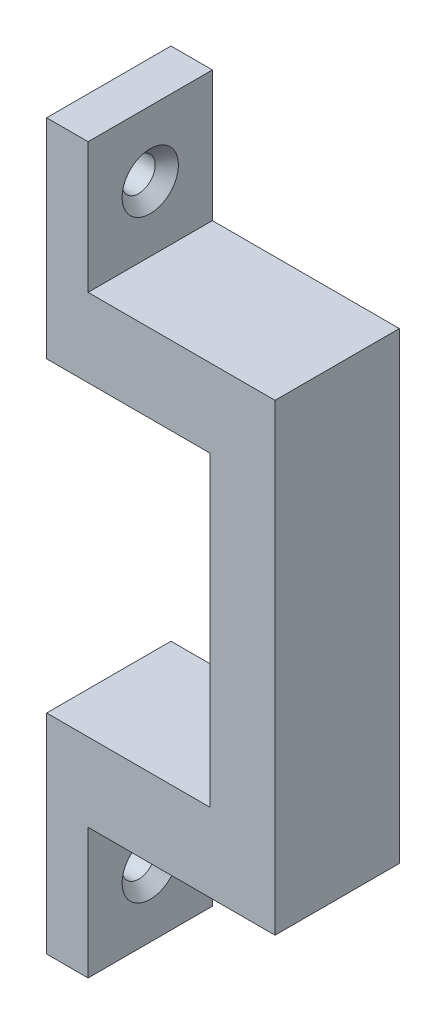
ISO-10303-21;
HEADER;
FILE_DESCRIPTION(('STEP AP214'),'2;1');
FILE_NAME('part.step','',(''),(''),'','','');
FILE_SCHEMA(('AUTOMOTIVE_DESIGN { 1 0 10303 214 1 1 1 1 }'));
ENDSEC;
DATA;
#1=APPLICATION_CONTEXT('core data for automotive mechanical design processes');
#2=APPLICATION_PROTOCOL_DEFINITION('international standard','automotive_design',2000,#1);
#3=PRODUCT_CONTEXT('',#1,'mechanical');
#4=PRODUCT('Part','Part','',(#3));
#5=PRODUCT_RELATED_PRODUCT_CATEGORY('part','',(#4));
#6=PRODUCT_DEFINITION_FORMATION('','',#4);
#7=PRODUCT_DEFINITION_CONTEXT('part definition',#1,'design');
#8=PRODUCT_DEFINITION('design','',#6,#7);
#9=PRODUCT_DEFINITION_SHAPE('','',#8);
#10=(LENGTH_UNIT() NAMED_UNIT(*) SI_UNIT(.MILLI.,.METRE.));
#11=(NAMED_UNIT(*) PLANE_ANGLE_UNIT() SI_UNIT($,.RADIAN.));
#12=(NAMED_UNIT(*) SI_UNIT($,.STERADIAN.) SOLID_ANGLE_UNIT());
#13=UNCERTAINTY_MEASURE_WITH_UNIT(LENGTH_MEASURE(1.E-05),#10,'distance_accuracy_value','');
#14=(GEOMETRIC_REPRESENTATION_CONTEXT(3) GLOBAL_UNCERTAINTY_ASSIGNED_CONTEXT((#13)) GLOBAL_UNIT_ASSIGNED_CONTEXT((#10,
#11,#12)) REPRESENTATION_CONTEXT('',''));
#15=CARTESIAN_POINT('',(0.,0.,0.));
#16=DIRECTION('',(0.,0.,1.));
#17=DIRECTION('',(1.,0.,0.));
#18=AXIS2_PLACEMENT_3D('',#15,#16,#17);
#19=CARTESIAN_POINT('',(-12.5,11.75,9.525));
#20=DIRECTION('',(1.,0.,0.));
#21=DIRECTION('',(0.,1.,0.));
#22=AXIS2_PLACEMENT_3D('',#19,#20,#21);
#23=PLANE('',#22);
#24=CARTESIAN_POINT('',(-12.5,22.75,4.7625));
#25=DIRECTION('',(1.,0.,0.));
#26=DIRECTION('',(0.,0.,-1.));
#27=AXIS2_PLACEMENT_3D('',#24,#25,#26);
#28=CIRCLE('',#27,1.27);
#29=CARTESIAN_POINT('',(-12.5,22.75,3.4925));
#30=VERTEX_POINT('',#29);
#31=EDGE_CURVE('E304',#30,#30,#28,.T.);
#32=ORIENTED_EDGE('',*,*,#31,.T.);
#33=EDGE_LOOP('',(#32));
#34=FACE_BOUND('',#33,.T.);
#35=DIRECTION('',(0.,-1.,0.));
#36=VECTOR('',#35,1.);
#37=CARTESIAN_POINT('',(-12.5,11.75,0.));
#38=LINE('',#37,#36);
#39=CARTESIAN_POINT('',(-12.5,27.75,0.));
#40=VERTEX_POINT('',#39);
#41=CARTESIAN_POINT('',(-12.5,11.75,0.));
#42=VERTEX_POINT('',#41);
#43=EDGE_CURVE('E167',#40,#42,#38,.T.);
#44=ORIENTED_EDGE('',*,*,#43,.T.);
#45=DIRECTION('',(0.,0.,-1.));
#46=VECTOR('',#45,1.);
#47=CARTESIAN_POINT('',(-12.5,11.75,9.525));
#48=LINE('',#47,#46);
#49=CARTESIAN_POINT('',(-12.5,11.75,9.525));
#50=VERTEX_POINT('',#49);
#51=EDGE_CURVE('E11',#50,#42,#48,.T.);
#52=ORIENTED_EDGE('',*,*,#51,.F.);
#53=DIRECTION('',(0.,-1.,0.));
#54=VECTOR('',#53,1.);
#55=CARTESIAN_POINT('',(-12.5,11.75,9.525));
#56=LINE('',#55,#54);
#57=CARTESIAN_POINT('',(-12.5,27.75,9.525));
#58=VERTEX_POINT('',#57);
#59=EDGE_CURVE('E202',#58,#50,#56,.T.);
#60=ORIENTED_EDGE('',*,*,#59,.F.);
#61=DIRECTION('',(0.,0.,-1.));
#62=VECTOR('',#61,1.);
#63=CARTESIAN_POINT('',(-12.5,27.75,9.525));
#64=LINE('',#63,#62);
#65=EDGE_CURVE('E163',#58,#40,#64,.T.);
#66=ORIENTED_EDGE('',*,*,#65,.T.);
#67=EDGE_LOOP('',(#44,#52,#60,#66));
#68=FACE_BOUND('',#67,.T.);
#69=ADVANCED_FACE('F39',(#34,#68),#23,.F.);
#70=CARTESIAN_POINT('',(0.,11.75,9.525));
#71=DIRECTION('',(0.,1.,0.));
#72=DIRECTION('',(-1.,0.,0.));
#73=AXIS2_PLACEMENT_3D('',#70,#71,#72);
#74=PLANE('',#73);
#75=DIRECTION('',(1.,0.,0.));
#76=VECTOR('',#75,1.);
#77=CARTESIAN_POINT('',(0.,11.75,0.));
#78=LINE('',#77,#76);
#79=CARTESIAN_POINT('',(0.,11.75,0.));
#80=VERTEX_POINT('',#79);
#81=EDGE_CURVE('E171',#42,#80,#78,.T.);
#82=ORIENTED_EDGE('',*,*,#81,.T.);
#83=DIRECTION('',(0.,0.,-1.));
#84=VECTOR('',#83,1.);
#85=CARTESIAN_POINT('',(0.,11.75,9.525));
#86=LINE('',#85,#84);
#87=CARTESIAN_POINT('',(0.,11.75,9.525));
#88=VERTEX_POINT('',#87);
#89=EDGE_CURVE('E48',#88,#80,#86,.T.);
#90=ORIENTED_EDGE('',*,*,#89,.F.);
#91=DIRECTION('',(1.,0.,0.));
#92=VECTOR('',#91,1.);
#93=CARTESIAN_POINT('',(0.,11.75,9.525));
#94=LINE('',#93,#92);
#95=EDGE_CURVE('E112',#50,#88,#94,.T.);
#96=ORIENTED_EDGE('',*,*,#95,.F.);
#97=ORIENTED_EDGE('',*,*,#51,.T.);
#98=EDGE_LOOP('',(#82,#90,#96,#97));
#99=FACE_BOUND('',#98,.T.);
#100=ADVANCED_FACE('F297',(#99),#74,.F.);
#101=CARTESIAN_POINT('',(0.,11.75,9.525));
#102=DIRECTION('',(1.,0.,0.));
#103=DIRECTION('',(0.,1.,0.));
#104=AXIS2_PLACEMENT_3D('',#101,#102,#103);
#105=PLANE('',#104);
#106=DIRECTION('',(0.,-1.,0.));
#107=VECTOR('',#106,1.);
#108=CARTESIAN_POINT('',(0.,11.75,0.));
#109=LINE('',#108,#107);
#110=CARTESIAN_POINT('',(0.,-11.75,0.));
#111=VERTEX_POINT('',#110);
#112=EDGE_CURVE('E175',#80,#111,#109,.T.);
#113=ORIENTED_EDGE('',*,*,#112,.T.);
#114=DIRECTION('',(0.,0.,-1.));
#115=VECTOR('',#114,1.);
#116=CARTESIAN_POINT('',(0.,-11.75,9.525));
#117=LINE('',#116,#115);
#118=CARTESIAN_POINT('',(0.,-11.75,9.525));
#119=VERTEX_POINT('',#118);
#120=EDGE_CURVE('E229',#119,#111,#117,.T.);
#121=ORIENTED_EDGE('',*,*,#120,.F.);
#122=DIRECTION('',(0.,-1.,0.));
#123=VECTOR('',#122,1.);
#124=CARTESIAN_POINT('',(0.,11.75,9.525));
#125=LINE('',#124,#123);
#126=EDGE_CURVE('E239',#88,#119,#125,.T.);
#127=ORIENTED_EDGE('',*,*,#126,.F.);
#128=ORIENTED_EDGE('',*,*,#89,.T.);
#129=EDGE_LOOP('',(#113,#121,#127,#128));
#130=FACE_BOUND('',#129,.T.);
#131=ADVANCED_FACE('F237',(#130),#105,.F.);
#132=CARTESIAN_POINT('',(-12.5,-11.75,9.525));
#133=DIRECTION('',(0.,-1.,0.));
#134=DIRECTION('',(0.,0.,-1.));
#135=AXIS2_PLACEMENT_3D('',#132,#133,#134);
#136=PLANE('',#135);
#137=DIRECTION('',(-1.,0.,0.));
#138=VECTOR('',#137,1.);
#139=CARTESIAN_POINT('',(-12.5,-11.75,0.));
#140=LINE('',#139,#138);
#141=CARTESIAN_POINT('',(-12.5,-11.75,0.));
#142=VERTEX_POINT('',#141);
#143=EDGE_CURVE('E178',#111,#142,#140,.T.);
#144=ORIENTED_EDGE('',*,*,#143,.T.);
#145=DIRECTION('',(0.,0.,-1.));
#146=VECTOR('',#145,1.);
#147=CARTESIAN_POINT('',(-12.5,-11.75,9.525));
#148=LINE('',#147,#146);
#149=CARTESIAN_POINT('',(-12.5,-11.75,9.525));
#150=VERTEX_POINT('',#149);
#151=EDGE_CURVE('E225',#150,#142,#148,.T.);
#152=ORIENTED_EDGE('',*,*,#151,.F.);
#153=DIRECTION('',(-1.,0.,0.));
#154=VECTOR('',#153,1.);
#155=CARTESIAN_POINT('',(-12.5,-11.75,9.525));
#156=LINE('',#155,#154);
#157=EDGE_CURVE('E258',#119,#150,#156,.T.);
#158=ORIENTED_EDGE('',*,*,#157,.F.);
#159=ORIENTED_EDGE('',*,*,#120,.T.);
#160=EDGE_LOOP('',(#144,#152,#158,#159));
#161=FACE_BOUND('',#160,.T.);
#162=ADVANCED_FACE('F248',(#161),#136,.F.);
#163=CARTESIAN_POINT('',(-12.5,-27.75,9.525));
#164=DIRECTION('',(1.,0.,0.));
#165=DIRECTION('',(0.,0.,-1.));
#166=AXIS2_PLACEMENT_3D('',#163,#164,#165);
#167=PLANE('',#166);
#168=CARTESIAN_POINT('',(-12.5,-22.75,4.7625));
#169=DIRECTION('',(1.,0.,0.));
#170=DIRECTION('',(0.,0.,-1.));
#171=AXIS2_PLACEMENT_3D('',#168,#169,#170);
#172=CIRCLE('',#171,1.27);
#173=CARTESIAN_POINT('',(-12.5,-22.75,3.4925));
#174=VERTEX_POINT('',#173);
#175=EDGE_CURVE('E323',#174,#174,#172,.T.);
#176=ORIENTED_EDGE('',*,*,#175,.T.);
#177=EDGE_LOOP('',(#176));
#178=FACE_BOUND('',#177,.T.);
#179=DIRECTION('',(0.,-1.,0.));
#180=VECTOR('',#179,1.);
#181=CARTESIAN_POINT('',(-12.5,-27.75,0.));
#182=LINE('',#181,#180);
#183=CARTESIAN_POINT('',(-12.5,-27.75,0.));
#184=VERTEX_POINT('',#183);
#185=EDGE_CURVE('E181',#142,#184,#182,.T.);
#186=ORIENTED_EDGE('',*,*,#185,.T.);
#187=DIRECTION('',(0.,0.,-1.));
#188=VECTOR('',#187,1.);
#189=CARTESIAN_POINT('',(-12.5,-27.75,9.525));
#190=LINE('',#189,#188);
#191=CARTESIAN_POINT('',(-12.5,-27.75,9.525));
#192=VERTEX_POINT('',#191);
#193=EDGE_CURVE('E221',#192,#184,#190,.T.);
#194=ORIENTED_EDGE('',*,*,#193,.F.);
#195=DIRECTION('',(0.,-1.,0.));
#196=VECTOR('',#195,1.);
#197=CARTESIAN_POINT('',(-12.5,-27.75,9.525));
#198=LINE('',#197,#196);
#199=EDGE_CURVE('E254',#150,#192,#198,.T.);
#200=ORIENTED_EDGE('',*,*,#199,.F.);
#201=ORIENTED_EDGE('',*,*,#151,.T.);
#202=EDGE_LOOP('',(#186,#194,#200,#201));
#203=FACE_BOUND('',#202,.T.);
#204=ADVANCED_FACE('F252',(#178,#203),#167,.F.);
#205=CARTESIAN_POINT('',(-9.32499999999999,-27.75,9.525));
#206=DIRECTION('',(0.,1.,0.));
#207=DIRECTION('',(0.,0.,1.));
#208=AXIS2_PLACEMENT_3D('',#205,#206,#207);
#209=PLANE('',#208);
#210=DIRECTION('',(1.,0.,0.));
#211=VECTOR('',#210,1.);
#212=CARTESIAN_POINT('',(-9.32499999999999,-27.75,0.));
#213=LINE('',#212,#211);
#214=CARTESIAN_POINT('',(-9.32499999999999,-27.75,0.));
#215=VERTEX_POINT('',#214);
#216=EDGE_CURVE('E184',#184,#215,#213,.T.);
#217=ORIENTED_EDGE('',*,*,#216,.T.);
#218=DIRECTION('',(0.,0.,-1.));
#219=VECTOR('',#218,1.);
#220=CARTESIAN_POINT('',(-9.32499999999999,-27.75,9.525));
#221=LINE('',#220,#219);
#222=CARTESIAN_POINT('',(-9.32499999999999,-27.75,9.525));
#223=VERTEX_POINT('',#222);
#224=EDGE_CURVE('E217',#223,#215,#221,.T.);
#225=ORIENTED_EDGE('',*,*,#224,.F.);
#226=DIRECTION('',(1.,0.,0.));
#227=VECTOR('',#226,1.);
#228=CARTESIAN_POINT('',(-9.32499999999999,-27.75,9.525));
#229=LINE('',#228,#227);
#230=EDGE_CURVE('E257',#192,#223,#229,.T.);
#231=ORIENTED_EDGE('',*,*,#230,.F.);
#232=ORIENTED_EDGE('',*,*,#193,.T.);
#233=EDGE_LOOP('',(#217,#225,#231,#232));
#234=FACE_BOUND('',#233,.T.);
#235=ADVANCED_FACE('F471',(#234),#209,.F.);
#236=CARTESIAN_POINT('',(-9.325,-17.75,9.525));
#237=DIRECTION('',(-1.,0.,0.));
#238=DIRECTION('',(0.,-1.,0.));
#239=AXIS2_PLACEMENT_3D('',#236,#237,#238);
#240=PLANE('',#239);
#241=CARTESIAN_POINT('',(-9.325,-22.75,4.7625));
#242=DIRECTION('',(1.,0.,0.));
#243=DIRECTION('',(0.,0.,-1.));
#244=AXIS2_PLACEMENT_3D('',#241,#242,#243);
#245=CIRCLE('',#244,2.159);
#246=CARTESIAN_POINT('',(-9.325,-22.75,2.6035));
#247=VERTEX_POINT('',#246);
#248=EDGE_CURVE('E307',#247,#247,#245,.T.);
#249=ORIENTED_EDGE('',*,*,#248,.F.);
#250=EDGE_LOOP('',(#249));
#251=FACE_BOUND('',#250,.T.);
#252=DIRECTION('',(0.,1.,0.));
#253=VECTOR('',#252,1.);
#254=CARTESIAN_POINT('',(-9.325,-17.75,0.));
#255=LINE('',#254,#253);
#256=CARTESIAN_POINT('',(-9.325,-17.75,0.));
#257=VERTEX_POINT('',#256);
#258=EDGE_CURVE('E187',#215,#257,#255,.T.);
#259=ORIENTED_EDGE('',*,*,#258,.T.);
#260=DIRECTION('',(0.,0.,-1.));
#261=VECTOR('',#260,1.);
#262=CARTESIAN_POINT('',(-9.325,-17.75,9.525));
#263=LINE('',#262,#261);
#264=CARTESIAN_POINT('',(-9.325,-17.75,9.525));
#265=VERTEX_POINT('',#264);
#266=EDGE_CURVE('E213',#265,#257,#263,.T.);
#267=ORIENTED_EDGE('',*,*,#266,.F.);
#268=DIRECTION('',(0.,1.,0.));
#269=VECTOR('',#268,1.);
#270=CARTESIAN_POINT('',(-9.325,-17.75,9.525));
#271=LINE('',#270,#269);
#272=EDGE_CURVE('E262',#223,#265,#271,.T.);
#273=ORIENTED_EDGE('',*,*,#272,.F.);
#274=ORIENTED_EDGE('',*,*,#224,.T.);
#275=EDGE_LOOP('',(#259,#267,#273,#274));
#276=FACE_BOUND('',#275,.T.);
#277=ADVANCED_FACE('F464',(#251,#276),#240,.F.);
#278=CARTESIAN_POINT('',(5.,-17.75,9.525));
#279=DIRECTION('',(0.,1.,0.));
#280=DIRECTION('',(0.,0.,1.));
#281=AXIS2_PLACEMENT_3D('',#278,#279,#280);
#282=PLANE('',#281);
#283=DIRECTION('',(1.,0.,0.));
#284=VECTOR('',#283,1.);
#285=CARTESIAN_POINT('',(5.,-17.75,0.));
#286=LINE('',#285,#284);
#287=CARTESIAN_POINT('',(5.,-17.75,0.));
#288=VERTEX_POINT('',#287);
#289=EDGE_CURVE('E190',#257,#288,#286,.T.);
#290=ORIENTED_EDGE('',*,*,#289,.T.);
#291=DIRECTION('',(0.,0.,-1.));
#292=VECTOR('',#291,1.);
#293=CARTESIAN_POINT('',(5.,-17.75,9.525));
#294=LINE('',#293,#292);
#295=CARTESIAN_POINT('',(5.,-17.75,9.525));
#296=VERTEX_POINT('',#295);
#297=EDGE_CURVE('E209',#296,#288,#294,.T.);
#298=ORIENTED_EDGE('',*,*,#297,.F.);
#299=DIRECTION('',(1.,0.,0.));
#300=VECTOR('',#299,1.);
#301=CARTESIAN_POINT('',(5.,-17.75,9.525));
#302=LINE('',#301,#300);
#303=EDGE_CURVE('E269',#265,#296,#302,.T.);
#304=ORIENTED_EDGE('',*,*,#303,.F.);
#305=ORIENTED_EDGE('',*,*,#266,.T.);
#306=EDGE_LOOP('',(#290,#298,#304,#305));
#307=FACE_BOUND('',#306,.T.);
#308=ADVANCED_FACE('F277',(#307),#282,.F.);
#309=CARTESIAN_POINT('',(5.,17.75,9.525));
#310=DIRECTION('',(-1.,0.,0.));
#311=DIRECTION('',(0.,0.,1.));
#312=AXIS2_PLACEMENT_3D('',#309,#310,#311);
#313=PLANE('',#312);
#314=DIRECTION('',(0.,1.,0.));
#315=VECTOR('',#314,1.);
#316=CARTESIAN_POINT('',(5.,17.75,0.));
#317=LINE('',#316,#315);
#318=CARTESIAN_POINT('',(5.,17.75,0.));
#319=VERTEX_POINT('',#318);
#320=EDGE_CURVE('E193',#288,#319,#317,.T.);
#321=ORIENTED_EDGE('',*,*,#320,.T.);
#322=DIRECTION('',(0.,0.,-1.));
#323=VECTOR('',#322,1.);
#324=CARTESIAN_POINT('',(5.,17.75,9.525));
#325=LINE('',#324,#323);
#326=CARTESIAN_POINT('',(5.,17.75,9.525));
#327=VERTEX_POINT('',#326);
#328=EDGE_CURVE('E156',#327,#319,#325,.T.);
#329=ORIENTED_EDGE('',*,*,#328,.F.);
#330=DIRECTION('',(0.,1.,0.));
#331=VECTOR('',#330,1.);
#332=CARTESIAN_POINT('',(5.,17.75,9.525));
#333=LINE('',#332,#331);
#334=EDGE_CURVE('E145',#296,#327,#333,.T.);
#335=ORIENTED_EDGE('',*,*,#334,.F.);
#336=ORIENTED_EDGE('',*,*,#297,.T.);
#337=EDGE_LOOP('',(#321,#329,#335,#336));
#338=FACE_BOUND('',#337,.T.);
#339=ADVANCED_FACE('F281',(#338),#313,.F.);
#340=CARTESIAN_POINT('',(-9.325,17.75,9.525));
#341=DIRECTION('',(0.,-1.,0.));
#342=DIRECTION('',(0.,0.,-1.));
#343=AXIS2_PLACEMENT_3D('',#340,#341,#342);
#344=PLANE('',#343);
#345=DIRECTION('',(-1.,0.,0.));
#346=VECTOR('',#345,1.);
#347=CARTESIAN_POINT('',(-9.325,17.75,0.));
#348=LINE('',#347,#346);
#349=CARTESIAN_POINT('',(-9.325,17.75,0.));
#350=VERTEX_POINT('',#349);
#351=EDGE_CURVE('E154',#319,#350,#348,.T.);
#352=ORIENTED_EDGE('',*,*,#351,.T.);
#353=DIRECTION('',(0.,0.,-1.));
#354=VECTOR('',#353,1.);
#355=CARTESIAN_POINT('',(-9.325,17.75,9.525));
#356=LINE('',#355,#354);
#357=CARTESIAN_POINT('',(-9.325,17.75,9.525));
#358=VERTEX_POINT('',#357);
#359=EDGE_CURVE('E151',#358,#350,#356,.T.);
#360=ORIENTED_EDGE('',*,*,#359,.F.);
#361=DIRECTION('',(-1.,0.,0.));
#362=VECTOR('',#361,1.);
#363=CARTESIAN_POINT('',(-9.325,17.75,9.525));
#364=LINE('',#363,#362);
#365=EDGE_CURVE('E139',#327,#358,#364,.T.);
#366=ORIENTED_EDGE('',*,*,#365,.F.);
#367=ORIENTED_EDGE('',*,*,#328,.T.);
#368=EDGE_LOOP('',(#352,#360,#366,#367));
#369=FACE_BOUND('',#368,.T.);
#370=ADVANCED_FACE('F152',(#369),#344,.F.);
#371=CARTESIAN_POINT('',(-9.32499999999999,27.75,9.525));
#372=DIRECTION('',(-1.,0.,0.));
#373=DIRECTION('',(0.,-1.,0.));
#374=AXIS2_PLACEMENT_3D('',#371,#372,#373);
#375=PLANE('',#374);
#376=CARTESIAN_POINT('',(-9.325,22.75,4.7625));
#377=DIRECTION('',(1.,0.,0.));
#378=DIRECTION('',(0.,0.,-1.));
#379=AXIS2_PLACEMENT_3D('',#376,#377,#378);
#380=CIRCLE('',#379,2.159);
#381=CARTESIAN_POINT('',(-9.325,22.75,2.6035));
#382=VERTEX_POINT('',#381);
#383=EDGE_CURVE('E316',#382,#382,#380,.T.);
#384=ORIENTED_EDGE('',*,*,#383,.F.);
#385=EDGE_LOOP('',(#384));
#386=FACE_BOUND('',#385,.T.);
#387=DIRECTION('',(0.,1.,0.));
#388=VECTOR('',#387,1.);
#389=CARTESIAN_POINT('',(-9.32499999999999,27.75,0.));
#390=LINE('',#389,#388);
#391=CARTESIAN_POINT('',(-9.32499999999999,27.75,0.));
#392=VERTEX_POINT('',#391);
#393=EDGE_CURVE('E98',#350,#392,#390,.T.);
#394=ORIENTED_EDGE('',*,*,#393,.T.);
#395=DIRECTION('',(0.,0.,-1.));
#396=VECTOR('',#395,1.);
#397=CARTESIAN_POINT('',(-9.32499999999999,27.75,9.525));
#398=LINE('',#397,#396);
#399=CARTESIAN_POINT('',(-9.32499999999999,27.75,9.525));
#400=VERTEX_POINT('',#399);
#401=EDGE_CURVE('E157',#400,#392,#398,.T.);
#402=ORIENTED_EDGE('',*,*,#401,.F.);
#403=DIRECTION('',(0.,1.,0.));
#404=VECTOR('',#403,1.);
#405=CARTESIAN_POINT('',(-9.32499999999999,27.75,9.525));
#406=LINE('',#405,#404);
#407=EDGE_CURVE('E143',#358,#400,#406,.T.);
#408=ORIENTED_EDGE('',*,*,#407,.F.);
#409=ORIENTED_EDGE('',*,*,#359,.T.);
#410=EDGE_LOOP('',(#394,#402,#408,#409));
#411=FACE_BOUND('',#410,.T.);
#412=ADVANCED_FACE('F159',(#386,#411),#375,.F.);
#413=CARTESIAN_POINT('',(-12.5,27.75,9.525));
#414=DIRECTION('',(0.,-1.,0.));
#415=DIRECTION('',(0.,0.,-1.));
#416=AXIS2_PLACEMENT_3D('',#413,#414,#415);
#417=PLANE('',#416);
#418=DIRECTION('',(-1.,0.,0.));
#419=VECTOR('',#418,1.);
#420=CARTESIAN_POINT('',(-12.5,27.75,0.));
#421=LINE('',#420,#419);
#422=EDGE_CURVE('E104',#392,#40,#421,.T.);
#423=ORIENTED_EDGE('',*,*,#422,.T.);
#424=ORIENTED_EDGE('',*,*,#65,.F.);
#425=DIRECTION('',(-1.,0.,0.));
#426=VECTOR('',#425,1.);
#427=CARTESIAN_POINT('',(-12.5,27.75,9.525));
#428=LINE('',#427,#426);
#429=EDGE_CURVE('E56',#400,#58,#428,.T.);
#430=ORIENTED_EDGE('',*,*,#429,.F.);
#431=ORIENTED_EDGE('',*,*,#401,.T.);
#432=EDGE_LOOP('',(#423,#424,#430,#431));
#433=FACE_BOUND('',#432,.T.);
#434=ADVANCED_FACE('F285',(#433),#417,.F.);
#435=CARTESIAN_POINT('',(0.,0.,9.525));
#436=DIRECTION('',(0.,0.,-1.));
#437=DIRECTION('',(-1.,0.,0.));
#438=AXIS2_PLACEMENT_3D('',#435,#436,#437);
#439=PLANE('',#438);
#440=ORIENTED_EDGE('',*,*,#59,.T.);
#441=ORIENTED_EDGE('',*,*,#95,.T.);
#442=ORIENTED_EDGE('',*,*,#126,.T.);
#443=ORIENTED_EDGE('',*,*,#157,.T.);
#444=ORIENTED_EDGE('',*,*,#199,.T.);
#445=ORIENTED_EDGE('',*,*,#230,.T.);
#446=ORIENTED_EDGE('',*,*,#272,.T.);
#447=ORIENTED_EDGE('',*,*,#303,.T.);
#448=ORIENTED_EDGE('',*,*,#334,.T.);
#449=ORIENTED_EDGE('',*,*,#365,.T.);
#450=ORIENTED_EDGE('',*,*,#407,.T.);
#451=ORIENTED_EDGE('',*,*,#429,.T.);
#452=EDGE_LOOP('',(#440,#441,#442,#443,#444,#445,#446,#447,#448,#449,#450,#451));
#453=FACE_BOUND('',#452,.T.);
#454=ADVANCED_FACE('F141',(#453),#439,.F.);
#455=CARTESIAN_POINT('',(0.,0.,0.));
#456=DIRECTION('',(0.,0.,-1.));
#457=DIRECTION('',(-1.,0.,0.));
#458=AXIS2_PLACEMENT_3D('',#455,#456,#457);
#459=PLANE('',#458);
#460=CARTESIAN_POINT('',(-6.25,14.,0.));
#461=DIRECTION('',(0.,0.,-1.));
#462=DIRECTION('',(-1.,0.,0.));
#463=AXIS2_PLACEMENT_3D('',#460,#461,#462);
#464=CIRCLE('',#463,1.016);
#465=CARTESIAN_POINT('',(-7.266,14.,0.));
#466=VERTEX_POINT('',#465);
#467=EDGE_CURVE('E327',#466,#466,#464,.T.);
#468=ORIENTED_EDGE('',*,*,#467,.F.);
#469=EDGE_LOOP('',(#468));
#470=FACE_BOUND('',#469,.T.);
#471=CARTESIAN_POINT('',(-6.25,-14.,0.));
#472=DIRECTION('',(0.,0.,-1.));
#473=DIRECTION('',(-1.,0.,0.));
#474=AXIS2_PLACEMENT_3D('',#471,#472,#473);
#475=CIRCLE('',#474,1.016);
#476=CARTESIAN_POINT('',(-7.266,-14.,0.));
#477=VERTEX_POINT('',#476);
#478=EDGE_CURVE('E335',#477,#477,#475,.T.);
#479=ORIENTED_EDGE('',*,*,#478,.F.);
#480=EDGE_LOOP('',(#479));
#481=FACE_BOUND('',#480,.T.);
#482=ORIENTED_EDGE('',*,*,#43,.F.);
#483=ORIENTED_EDGE('',*,*,#422,.F.);
#484=ORIENTED_EDGE('',*,*,#393,.F.);
#485=ORIENTED_EDGE('',*,*,#351,.F.);
#486=ORIENTED_EDGE('',*,*,#320,.F.);
#487=ORIENTED_EDGE('',*,*,#289,.F.);
#488=ORIENTED_EDGE('',*,*,#258,.F.);
#489=ORIENTED_EDGE('',*,*,#216,.F.);
#490=ORIENTED_EDGE('',*,*,#185,.F.);
#491=ORIENTED_EDGE('',*,*,#143,.F.);
#492=ORIENTED_EDGE('',*,*,#112,.F.);
#493=ORIENTED_EDGE('',*,*,#81,.F.);
#494=EDGE_LOOP('',(#482,#483,#484,#485,#486,#487,#488,#489,#490,#491,#492,#493));
#495=FACE_BOUND('',#494,.T.);
#496=ADVANCED_FACE('F243',(#470,#481,#495),#459,.T.);
#497=CARTESIAN_POINT('',(-6.25,-14.,6.35));
#498=DIRECTION('',(0.,0.,-1.));
#499=DIRECTION('',(-1.,0.,0.));
#500=AXIS2_PLACEMENT_3D('',#497,#498,#499);
#501=CONICAL_SURFACE('',#500,1.016,1.02974425867665);
#502=CARTESIAN_POINT('',(-6.25000000000001,-14.,6.960474388932));
#503=VERTEX_POINT('',#502);
#504=VERTEX_LOOP('',#503);
#505=FACE_BOUND('',#504,.T.);
#506=CARTESIAN_POINT('',(-6.25,-14.,6.35));
#507=DIRECTION('',(0.,0.,-1.));
#508=DIRECTION('',(-1.,0.,0.));
#509=AXIS2_PLACEMENT_3D('',#506,#507,#508);
#510=CIRCLE('',#509,1.016);
#511=CARTESIAN_POINT('',(-7.266,-14.,6.35));
#512=VERTEX_POINT('',#511);
#513=EDGE_CURVE('E172',#512,#512,#510,.T.);
#514=ORIENTED_EDGE('',*,*,#513,.T.);
#515=EDGE_LOOP('',(#514));
#516=FACE_BOUND('',#515,.T.);
#517=ADVANCED_FACE('F348',(#505,#516),#501,.F.);
#518=CARTESIAN_POINT('',(-6.25,-14.,0.));
#519=DIRECTION('',(0.,0.,-1.));
#520=DIRECTION('',(-1.,0.,0.));
#521=AXIS2_PLACEMENT_3D('',#518,#519,#520);
#522=CYLINDRICAL_SURFACE('',#521,1.016);
#523=ORIENTED_EDGE('',*,*,#513,.F.);
#524=EDGE_LOOP('',(#523));
#525=FACE_BOUND('',#524,.T.);
#526=ORIENTED_EDGE('',*,*,#478,.T.);
#527=EDGE_LOOP('',(#526));
#528=FACE_BOUND('',#527,.T.);
#529=ADVANCED_FACE('F350',(#525,#528),#522,.F.);
#530=CARTESIAN_POINT('',(-6.25,14.,6.35));
#531=DIRECTION('',(0.,0.,-1.));
#532=DIRECTION('',(-1.,0.,0.));
#533=AXIS2_PLACEMENT_3D('',#530,#531,#532);
#534=CONICAL_SURFACE('',#533,1.016,1.02974425867665);
#535=CARTESIAN_POINT('',(-6.25000000000001,14.,6.960474388932));
#536=VERTEX_POINT('',#535);
#537=VERTEX_LOOP('',#536);
#538=FACE_BOUND('',#537,.T.);
#539=CARTESIAN_POINT('',(-6.25,14.,6.35));
#540=DIRECTION('',(0.,0.,-1.));
#541=DIRECTION('',(-1.,0.,0.));
#542=AXIS2_PLACEMENT_3D('',#539,#540,#541);
#543=CIRCLE('',#542,1.016);
#544=CARTESIAN_POINT('',(-7.266,14.,6.35));
#545=VERTEX_POINT('',#544);
#546=EDGE_CURVE('E331',#545,#545,#543,.T.);
#547=ORIENTED_EDGE('',*,*,#546,.T.);
#548=EDGE_LOOP('',(#547));
#549=FACE_BOUND('',#548,.T.);
#550=ADVANCED_FACE('F353',(#538,#549),#534,.F.);
#551=CARTESIAN_POINT('',(-6.25,14.,0.));
#552=DIRECTION('',(0.,0.,-1.));
#553=DIRECTION('',(-1.,0.,0.));
#554=AXIS2_PLACEMENT_3D('',#551,#552,#553);
#555=CYLINDRICAL_SURFACE('',#554,1.016);
#556=ORIENTED_EDGE('',*,*,#546,.F.);
#557=EDGE_LOOP('',(#556));
#558=FACE_BOUND('',#557,.T.);
#559=ORIENTED_EDGE('',*,*,#467,.T.);
#560=EDGE_LOOP('',(#559));
#561=FACE_BOUND('',#560,.T.);
#562=ADVANCED_FACE('F368',(#558,#561),#555,.F.);
#563=CARTESIAN_POINT('',(-9.325,-22.75,4.7625));
#564=DIRECTION('',(1.,0.,0.));
#565=DIRECTION('',(0.,0.,-1.));
#566=AXIS2_PLACEMENT_3D('',#563,#564,#565);
#567=CYLINDRICAL_SURFACE('',#566,1.27);
#568=ORIENTED_EDGE('',*,*,#175,.F.);
#569=EDGE_LOOP('',(#568));
#570=FACE_BOUND('',#569,.T.);
#571=CARTESIAN_POINT('',(-10.214,-22.75,4.7625));
#572=DIRECTION('',(1.,0.,0.));
#573=DIRECTION('',(0.,0.,-1.));
#574=AXIS2_PLACEMENT_3D('',#571,#572,#573);
#575=CIRCLE('',#574,1.27);
#576=CARTESIAN_POINT('',(-10.214,-22.75,3.4925));
#577=VERTEX_POINT('',#576);
#578=EDGE_CURVE('E313',#577,#577,#575,.T.);
#579=ORIENTED_EDGE('',*,*,#578,.T.);
#580=EDGE_LOOP('',(#579));
#581=FACE_BOUND('',#580,.T.);
#582=ADVANCED_FACE('F372',(#570,#581),#567,.F.);
#583=CARTESIAN_POINT('',(-9.325,-22.75,4.7625));
#584=DIRECTION('',(1.,0.,0.));
#585=DIRECTION('',(0.,0.,-1.));
#586=AXIS2_PLACEMENT_3D('',#583,#584,#585);
#587=CONICAL_SURFACE('',#586,2.159,0.785398163397449);
#588=ORIENTED_EDGE('',*,*,#578,.F.);
#589=EDGE_LOOP('',(#588));
#590=FACE_BOUND('',#589,.T.);
#591=ORIENTED_EDGE('',*,*,#248,.T.);
#592=EDGE_LOOP('',(#591));
#593=FACE_BOUND('',#592,.T.);
#594=ADVANCED_FACE('F376',(#590,#593),#587,.F.);
#595=CARTESIAN_POINT('',(-9.325,22.75,4.7625));
#596=DIRECTION('',(1.,0.,0.));
#597=DIRECTION('',(0.,0.,-1.));
#598=AXIS2_PLACEMENT_3D('',#595,#596,#597);
#599=CYLINDRICAL_SURFACE('',#598,1.27);
#600=ORIENTED_EDGE('',*,*,#31,.F.);
#601=EDGE_LOOP('',(#600));
#602=FACE_BOUND('',#601,.T.);
#603=CARTESIAN_POINT('',(-10.214,22.75,4.7625));
#604=DIRECTION('',(1.,0.,0.));
#605=DIRECTION('',(0.,0.,-1.));
#606=AXIS2_PLACEMENT_3D('',#603,#604,#605);
#607=CIRCLE('',#606,1.27);
#608=CARTESIAN_POINT('',(-10.214,22.75,3.4925));
#609=VERTEX_POINT('',#608);
#610=EDGE_CURVE('E308',#609,#609,#607,.T.);
#611=ORIENTED_EDGE('',*,*,#610,.T.);
#612=EDGE_LOOP('',(#611));
#613=FACE_BOUND('',#612,.T.);
#614=ADVANCED_FACE('F380',(#602,#613),#599,.F.);
#615=CARTESIAN_POINT('',(-9.325,22.75,4.7625));
#616=DIRECTION('',(1.,0.,0.));
#617=DIRECTION('',(0.,0.,-1.));
#618=AXIS2_PLACEMENT_3D('',#615,#616,#617);
#619=CONICAL_SURFACE('',#618,2.159,0.785398163397449);
#620=ORIENTED_EDGE('',*,*,#610,.F.);
#621=EDGE_LOOP('',(#620));
#622=FACE_BOUND('',#621,.T.);
#623=ORIENTED_EDGE('',*,*,#383,.T.);
#624=EDGE_LOOP('',(#623));
#625=FACE_BOUND('',#624,.T.);
#626=ADVANCED_FACE('F384',(#622,#625),#619,.F.);
#627=CLOSED_SHELL('',(#69,#100,#131,#162,#204,#235,#277,#308,#339,#370,#412,#434,#454,#496,#517,
#529,#550,#562,#582,#594,#614,#626));
#628=MANIFOLD_SOLID_BREP('B2',#627);
#629=ADVANCED_BREP_SHAPE_REPRESENTATION('',(#18,#628),#14);
#630=SHAPE_DEFINITION_REPRESENTATION(#9,#629);
ENDSEC;
END-ISO-10303-21;
